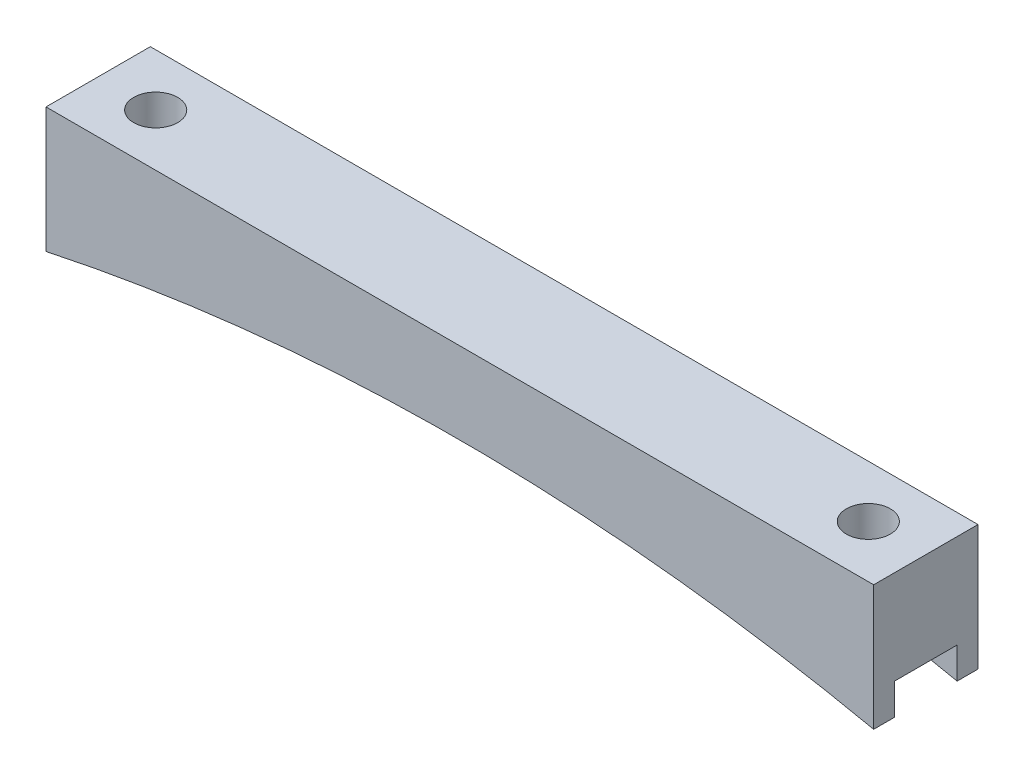
ISO-10303-21;
HEADER;
FILE_DESCRIPTION(('STEP AP214'),'2;1');
FILE_NAME('part.step','',(''),(''),'','','');
FILE_SCHEMA(('AUTOMOTIVE_DESIGN { 1 0 10303 214 1 1 1 1 }'));
ENDSEC;
DATA;
#1=APPLICATION_CONTEXT('core data for automotive mechanical design processes');
#2=APPLICATION_PROTOCOL_DEFINITION('international standard','automotive_design',2000,#1);
#3=PRODUCT_CONTEXT('',#1,'mechanical');
#4=PRODUCT('Part','Part','',(#3));
#5=PRODUCT_RELATED_PRODUCT_CATEGORY('part','',(#4));
#6=PRODUCT_DEFINITION_FORMATION('','',#4);
#7=PRODUCT_DEFINITION_CONTEXT('part definition',#1,'design');
#8=PRODUCT_DEFINITION('design','',#6,#7);
#9=PRODUCT_DEFINITION_SHAPE('','',#8);
#10=(LENGTH_UNIT() NAMED_UNIT(*) SI_UNIT(.MILLI.,.METRE.));
#11=(NAMED_UNIT(*) PLANE_ANGLE_UNIT() SI_UNIT($,.RADIAN.));
#12=(NAMED_UNIT(*) SI_UNIT($,.STERADIAN.) SOLID_ANGLE_UNIT());
#13=UNCERTAINTY_MEASURE_WITH_UNIT(LENGTH_MEASURE(1.E-05),#10,'distance_accuracy_value','');
#14=(GEOMETRIC_REPRESENTATION_CONTEXT(3) GLOBAL_UNCERTAINTY_ASSIGNED_CONTEXT((#13)) GLOBAL_UNIT_ASSIGNED_CONTEXT((#10,
#11,#12)) REPRESENTATION_CONTEXT('',''));
#15=CARTESIAN_POINT('',(0.,0.,0.));
#16=DIRECTION('',(0.,0.,1.));
#17=DIRECTION('',(1.,0.,0.));
#18=AXIS2_PLACEMENT_3D('',#15,#16,#17);
#19=CARTESIAN_POINT('',(50.37,0.,12.7));
#20=DIRECTION('',(-1.,0.,0.));
#21=DIRECTION('',(0.,0.,1.));
#22=AXIS2_PLACEMENT_3D('',#19,#20,#21);
#23=PLANE('',#22);
#24=DIRECTION('',(0.,0.,-1.));
#25=VECTOR('',#24,1.);
#26=CARTESIAN_POINT('',(50.37,-15.24,12.7));
#27=LINE('',#26,#25);
#28=CARTESIAN_POINT('',(50.37,-15.24,12.7));
#29=VERTEX_POINT('',#28);
#30=CARTESIAN_POINT('',(50.37,-15.24,10.16));
#31=VERTEX_POINT('',#30);
#32=EDGE_CURVE('E156',#29,#31,#27,.T.);
#33=ORIENTED_EDGE('',*,*,#32,.T.);
#34=DIRECTION('',(0.,-1.,0.));
#35=VECTOR('',#34,1.);
#36=CARTESIAN_POINT('',(50.37,-15.24,10.16));
#37=LINE('',#36,#35);
#38=CARTESIAN_POINT('',(50.37,-11.43,10.16));
#39=VERTEX_POINT('',#38);
#40=EDGE_CURVE('E185',#39,#31,#37,.T.);
#41=ORIENTED_EDGE('',*,*,#40,.F.);
#42=DIRECTION('',(0.,0.,1.));
#43=VECTOR('',#42,1.);
#44=CARTESIAN_POINT('',(50.37,-11.43,10.16));
#45=LINE('',#44,#43);
#46=CARTESIAN_POINT('',(50.37,-11.43,2.54));
#47=VERTEX_POINT('',#46);
#48=EDGE_CURVE('E141',#47,#39,#45,.T.);
#49=ORIENTED_EDGE('',*,*,#48,.F.);
#50=DIRECTION('',(0.,1.,0.));
#51=VECTOR('',#50,1.);
#52=CARTESIAN_POINT('',(50.37,-15.24,2.54));
#53=LINE('',#52,#51);
#54=CARTESIAN_POINT('',(50.37,-15.24,2.54));
#55=VERTEX_POINT('',#54);
#56=EDGE_CURVE('E177',#55,#47,#53,.T.);
#57=ORIENTED_EDGE('',*,*,#56,.F.);
#58=CARTESIAN_POINT('',(50.37,-15.24,0.));
#59=VERTEX_POINT('',#58);
#60=EDGE_CURVE('E174',#55,#59,#27,.T.);
#61=ORIENTED_EDGE('',*,*,#60,.T.);
#62=DIRECTION('',(0.,1.,0.));
#63=VECTOR('',#62,1.);
#64=CARTESIAN_POINT('',(50.37,0.,0.));
#65=LINE('',#64,#63);
#66=CARTESIAN_POINT('',(50.37,0.,0.));
#67=VERTEX_POINT('',#66);
#68=EDGE_CURVE('E213',#59,#67,#65,.T.);
#69=ORIENTED_EDGE('',*,*,#68,.T.);
#70=DIRECTION('',(0.,0.,-1.));
#71=VECTOR('',#70,1.);
#72=CARTESIAN_POINT('',(50.37,0.,12.7));
#73=LINE('',#72,#71);
#74=CARTESIAN_POINT('',(50.37,0.,12.7));
#75=VERTEX_POINT('',#74);
#76=EDGE_CURVE('E154',#75,#67,#73,.T.);
#77=ORIENTED_EDGE('',*,*,#76,.F.);
#78=DIRECTION('',(0.,1.,0.));
#79=VECTOR('',#78,1.);
#80=CARTESIAN_POINT('',(50.37,0.,12.7));
#81=LINE('',#80,#79);
#82=EDGE_CURVE('E217',#29,#75,#81,.T.);
#83=ORIENTED_EDGE('',*,*,#82,.F.);
#84=EDGE_LOOP('',(#33,#41,#49,#57,#61,#69,#77,#83));
#85=FACE_BOUND('',#84,.T.);
#86=ADVANCED_FACE('F43',(#85),#23,.F.);
#87=CARTESIAN_POINT('',(-50.37,0.,12.7));
#88=DIRECTION('',(0.,-1.,0.));
#89=DIRECTION('',(1.,0.,0.));
#90=AXIS2_PLACEMENT_3D('',#87,#88,#89);
#91=PLANE('',#90);
#92=CARTESIAN_POINT('',(-43.37,0.,6.35));
#93=DIRECTION('',(0.,1.,0.));
#94=DIRECTION('',(-1.,0.,0.));
#95=AXIS2_PLACEMENT_3D('',#92,#93,#94);
#96=CIRCLE('',#95,2.675);
#97=CARTESIAN_POINT('',(-46.045,0.,6.35));
#98=VERTEX_POINT('',#97);
#99=EDGE_CURVE('E209',#98,#98,#96,.T.);
#100=ORIENTED_EDGE('',*,*,#99,.F.);
#101=EDGE_LOOP('',(#100));
#102=FACE_BOUND('',#101,.T.);
#103=CARTESIAN_POINT('',(43.37,0.,6.35));
#104=DIRECTION('',(0.,1.,0.));
#105=DIRECTION('',(-1.,0.,0.));
#106=AXIS2_PLACEMENT_3D('',#103,#104,#105);
#107=CIRCLE('',#106,2.675);
#108=CARTESIAN_POINT('',(40.695,0.,6.35));
#109=VERTEX_POINT('',#108);
#110=EDGE_CURVE('E208',#109,#109,#107,.T.);
#111=ORIENTED_EDGE('',*,*,#110,.F.);
#112=EDGE_LOOP('',(#111));
#113=FACE_BOUND('',#112,.T.);
#114=DIRECTION('',(-1.,0.,0.));
#115=VECTOR('',#114,1.);
#116=CARTESIAN_POINT('',(-50.37,0.,0.));
#117=LINE('',#116,#115);
#118=CARTESIAN_POINT('',(-50.37,0.,0.));
#119=VERTEX_POINT('',#118);
#120=EDGE_CURVE('E232',#67,#119,#117,.T.);
#121=ORIENTED_EDGE('',*,*,#120,.T.);
#122=DIRECTION('',(0.,0.,-1.));
#123=VECTOR('',#122,1.);
#124=CARTESIAN_POINT('',(-50.37,0.,12.7));
#125=LINE('',#124,#123);
#126=CARTESIAN_POINT('',(-50.37,0.,12.7));
#127=VERTEX_POINT('',#126);
#128=EDGE_CURVE('E148',#127,#119,#125,.T.);
#129=ORIENTED_EDGE('',*,*,#128,.F.);
#130=DIRECTION('',(-1.,0.,0.));
#131=VECTOR('',#130,1.);
#132=CARTESIAN_POINT('',(-50.37,0.,12.7));
#133=LINE('',#132,#131);
#134=EDGE_CURVE('E221',#75,#127,#133,.T.);
#135=ORIENTED_EDGE('',*,*,#134,.F.);
#136=ORIENTED_EDGE('',*,*,#76,.T.);
#137=EDGE_LOOP('',(#121,#129,#135,#136));
#138=FACE_BOUND('',#137,.T.);
#139=ADVANCED_FACE('F247',(#102,#113,#138),#91,.F.);
#140=CARTESIAN_POINT('',(-50.37,0.,12.7));
#141=DIRECTION('',(1.,0.,0.));
#142=DIRECTION('',(0.,0.,-1.));
#143=AXIS2_PLACEMENT_3D('',#140,#141,#142);
#144=PLANE('',#143);
#145=DIRECTION('',(0.,0.,1.));
#146=VECTOR('',#145,1.);
#147=CARTESIAN_POINT('',(-50.37,-11.43,10.16));
#148=LINE('',#147,#146);
#149=CARTESIAN_POINT('',(-50.37,-11.43,2.54));
#150=VERTEX_POINT('',#149);
#151=CARTESIAN_POINT('',(-50.37,-11.43,10.16));
#152=VERTEX_POINT('',#151);
#153=EDGE_CURVE('E139',#150,#152,#148,.T.);
#154=ORIENTED_EDGE('',*,*,#153,.T.);
#155=DIRECTION('',(0.,-1.,0.));
#156=VECTOR('',#155,1.);
#157=CARTESIAN_POINT('',(-50.37,-15.24,10.16));
#158=LINE('',#157,#156);
#159=CARTESIAN_POINT('',(-50.37,-15.24,10.16));
#160=VERTEX_POINT('',#159);
#161=EDGE_CURVE('E124',#152,#160,#158,.T.);
#162=ORIENTED_EDGE('',*,*,#161,.T.);
#163=DIRECTION('',(0.,0.,-1.));
#164=VECTOR('',#163,1.);
#165=CARTESIAN_POINT('',(-50.37,-15.24,12.7));
#166=LINE('',#165,#164);
#167=CARTESIAN_POINT('',(-50.37,-15.24,12.7));
#168=VERTEX_POINT('',#167);
#169=EDGE_CURVE('E136',#168,#160,#166,.T.);
#170=ORIENTED_EDGE('',*,*,#169,.F.);
#171=DIRECTION('',(0.,-1.,0.));
#172=VECTOR('',#171,1.);
#173=CARTESIAN_POINT('',(-50.37,0.,12.7));
#174=LINE('',#173,#172);
#175=EDGE_CURVE('E225',#127,#168,#174,.T.);
#176=ORIENTED_EDGE('',*,*,#175,.F.);
#177=ORIENTED_EDGE('',*,*,#128,.T.);
#178=DIRECTION('',(0.,-1.,0.));
#179=VECTOR('',#178,1.);
#180=CARTESIAN_POINT('',(-50.37,0.,0.));
#181=LINE('',#180,#179);
#182=CARTESIAN_POINT('',(-50.37,-15.24,0.));
#183=VERTEX_POINT('',#182);
#184=EDGE_CURVE('E235',#119,#183,#181,.T.);
#185=ORIENTED_EDGE('',*,*,#184,.T.);
#186=CARTESIAN_POINT('',(-50.37,-15.24,2.54));
#187=VERTEX_POINT('',#186);
#188=EDGE_CURVE('E149',#187,#183,#166,.T.);
#189=ORIENTED_EDGE('',*,*,#188,.F.);
#190=DIRECTION('',(0.,1.,0.));
#191=VECTOR('',#190,1.);
#192=CARTESIAN_POINT('',(-50.37,-15.24,2.54));
#193=LINE('',#192,#191);
#194=EDGE_CURVE('E67',#187,#150,#193,.T.);
#195=ORIENTED_EDGE('',*,*,#194,.T.);
#196=EDGE_LOOP('',(#154,#162,#170,#176,#177,#185,#189,#195));
#197=FACE_BOUND('',#196,.T.);
#198=ADVANCED_FACE('F134',(#197),#144,.F.);
#199=CARTESIAN_POINT('',(0.,-251.224222142075,12.7));
#200=DIRECTION('',(0.,0.,-1.));
#201=DIRECTION('',(-1.,0.,0.));
#202=AXIS2_PLACEMENT_3D('',#199,#200,#201);
#203=CYLINDRICAL_SURFACE('',#202,241.3);
#204=DIRECTION('',(0.,0.,-1.));
#205=VECTOR('',#204,1.);
#206=CARTESIAN_POINT('',(26.9150706348206,-11.43,12.7));
#207=LINE('',#206,#205);
#208=CARTESIAN_POINT('',(26.9150706348206,-11.43,2.54));
#209=VERTEX_POINT('',#208);
#210=CARTESIAN_POINT('',(26.9150706348207,-11.43,10.16));
#211=VERTEX_POINT('',#210);
#212=EDGE_CURVE('E172',#209,#211,#207,.F.);
#213=ORIENTED_EDGE('',*,*,#212,.T.);
#214=CARTESIAN_POINT('',(0.,-251.224222142075,10.16));
#215=DIRECTION('',(0.,0.,1.));
#216=DIRECTION('',(1.,0.,0.));
#217=AXIS2_PLACEMENT_3D('',#214,#215,#216);
#218=CIRCLE('',#217,241.3);
#219=EDGE_CURVE('E11',#211,#31,#218,.F.);
#220=ORIENTED_EDGE('',*,*,#219,.T.);
#221=ORIENTED_EDGE('',*,*,#32,.F.);
#222=CARTESIAN_POINT('',(0.,-251.224222142075,12.7));
#223=DIRECTION('',(0.,0.,-1.));
#224=DIRECTION('',(-1.,0.,0.));
#225=AXIS2_PLACEMENT_3D('',#222,#223,#224);
#226=CIRCLE('',#225,241.3);
#227=EDGE_CURVE('E146',#168,#29,#226,.T.);
#228=ORIENTED_EDGE('',*,*,#227,.F.);
#229=ORIENTED_EDGE('',*,*,#169,.T.);
#230=CARTESIAN_POINT('',(-26.9150706348206,-11.43,10.16));
#231=VERTEX_POINT('',#230);
#232=EDGE_CURVE('E46',#160,#231,#218,.F.);
#233=ORIENTED_EDGE('',*,*,#232,.T.);
#234=DIRECTION('',(0.,0.,-1.));
#235=VECTOR('',#234,1.);
#236=CARTESIAN_POINT('',(-26.9150706348206,-11.43,12.7));
#237=LINE('',#236,#235);
#238=CARTESIAN_POINT('',(-26.9150706348206,-11.43,2.54));
#239=VERTEX_POINT('',#238);
#240=EDGE_CURVE('E203',#231,#239,#237,.T.);
#241=ORIENTED_EDGE('',*,*,#240,.T.);
#242=CARTESIAN_POINT('',(0.,-251.224222142075,2.54));
#243=DIRECTION('',(0.,0.,-1.));
#244=DIRECTION('',(-1.,0.,0.));
#245=AXIS2_PLACEMENT_3D('',#242,#243,#244);
#246=CIRCLE('',#245,241.3);
#247=EDGE_CURVE('E131',#239,#187,#246,.F.);
#248=ORIENTED_EDGE('',*,*,#247,.T.);
#249=ORIENTED_EDGE('',*,*,#188,.T.);
#250=CARTESIAN_POINT('',(0.,-251.224222142075,0.));
#251=DIRECTION('',(0.,0.,-1.));
#252=DIRECTION('',(-1.,0.,0.));
#253=AXIS2_PLACEMENT_3D('',#250,#251,#252);
#254=CIRCLE('',#253,241.3);
#255=EDGE_CURVE('E222',#183,#59,#254,.T.);
#256=ORIENTED_EDGE('',*,*,#255,.T.);
#257=ORIENTED_EDGE('',*,*,#60,.F.);
#258=EDGE_CURVE('E52',#55,#209,#246,.F.);
#259=ORIENTED_EDGE('',*,*,#258,.T.);
#260=EDGE_LOOP('',(#213,#220,#221,#228,#229,#233,#241,#248,#249,#256,#257,#259));
#261=FACE_BOUND('',#260,.T.);
#262=ADVANCED_FACE('F144',(#261),#203,.F.);
#263=CARTESIAN_POINT('',(0.,-251.224222142075,12.7));
#264=DIRECTION('',(0.,0.,-1.));
#265=DIRECTION('',(-1.,0.,0.));
#266=AXIS2_PLACEMENT_3D('',#263,#264,#265);
#267=PLANE('',#266);
#268=ORIENTED_EDGE('',*,*,#82,.T.);
#269=ORIENTED_EDGE('',*,*,#134,.T.);
#270=ORIENTED_EDGE('',*,*,#175,.T.);
#271=ORIENTED_EDGE('',*,*,#227,.T.);
#272=EDGE_LOOP('',(#268,#269,#270,#271));
#273=FACE_BOUND('',#272,.T.);
#274=ADVANCED_FACE('F250',(#273),#267,.F.);
#275=CARTESIAN_POINT('',(0.,-251.224222142075,0.));
#276=DIRECTION('',(0.,0.,-1.));
#277=DIRECTION('',(-1.,0.,0.));
#278=AXIS2_PLACEMENT_3D('',#275,#276,#277);
#279=PLANE('',#278);
#280=ORIENTED_EDGE('',*,*,#68,.F.);
#281=ORIENTED_EDGE('',*,*,#255,.F.);
#282=ORIENTED_EDGE('',*,*,#184,.F.);
#283=ORIENTED_EDGE('',*,*,#120,.F.);
#284=EDGE_LOOP('',(#280,#281,#282,#283));
#285=FACE_BOUND('',#284,.T.);
#286=ADVANCED_FACE('F243',(#285),#279,.T.);
#287=CARTESIAN_POINT('',(43.37,-15.24,6.35));
#288=DIRECTION('',(0.,1.,0.));
#289=DIRECTION('',(-1.,0.,0.));
#290=AXIS2_PLACEMENT_3D('',#287,#288,#289);
#291=CYLINDRICAL_SURFACE('',#290,2.675);
#292=CARTESIAN_POINT('',(43.37,-11.43,6.35));
#293=DIRECTION('',(0.,1.,0.));
#294=DIRECTION('',(0.,0.,1.));
#295=AXIS2_PLACEMENT_3D('',#292,#293,#294);
#296=CIRCLE('',#295,2.675);
#297=CARTESIAN_POINT('',(43.37,-11.43,9.025));
#298=VERTEX_POINT('',#297);
#299=EDGE_CURVE('E166',#298,#298,#296,.F.);
#300=ORIENTED_EDGE('',*,*,#299,.T.);
#301=EDGE_LOOP('',(#300));
#302=FACE_BOUND('',#301,.T.);
#303=ORIENTED_EDGE('',*,*,#110,.T.);
#304=EDGE_LOOP('',(#303));
#305=FACE_BOUND('',#304,.T.);
#306=ADVANCED_FACE('F292',(#302,#305),#291,.F.);
#307=CARTESIAN_POINT('',(-43.37,-15.24,6.35));
#308=DIRECTION('',(0.,1.,0.));
#309=DIRECTION('',(-1.,0.,0.));
#310=AXIS2_PLACEMENT_3D('',#307,#308,#309);
#311=CYLINDRICAL_SURFACE('',#310,2.675);
#312=CARTESIAN_POINT('',(-43.37,-11.43,6.35));
#313=DIRECTION('',(0.,1.,0.));
#314=DIRECTION('',(0.,0.,1.));
#315=AXIS2_PLACEMENT_3D('',#312,#313,#314);
#316=CIRCLE('',#315,2.675);
#317=CARTESIAN_POINT('',(-43.37,-11.43,9.025));
#318=VERTEX_POINT('',#317);
#319=EDGE_CURVE('E163',#318,#318,#316,.F.);
#320=ORIENTED_EDGE('',*,*,#319,.T.);
#321=EDGE_LOOP('',(#320));
#322=FACE_BOUND('',#321,.T.);
#323=ORIENTED_EDGE('',*,*,#99,.T.);
#324=EDGE_LOOP('',(#323));
#325=FACE_BOUND('',#324,.T.);
#326=ADVANCED_FACE('F274',(#322,#325),#311,.F.);
#327=CARTESIAN_POINT('',(-50.37,-11.43,10.16));
#328=DIRECTION('',(0.,1.,0.));
#329=DIRECTION('',(0.,0.,1.));
#330=AXIS2_PLACEMENT_3D('',#327,#328,#329);
#331=PLANE('',#330);
#332=ORIENTED_EDGE('',*,*,#319,.F.);
#333=EDGE_LOOP('',(#332));
#334=FACE_BOUND('',#333,.T.);
#335=DIRECTION('',(1.,0.,0.));
#336=VECTOR('',#335,1.);
#337=CARTESIAN_POINT('',(-50.37,-11.43,10.16));
#338=LINE('',#337,#336);
#339=EDGE_CURVE('E126',#152,#231,#338,.T.);
#340=ORIENTED_EDGE('',*,*,#339,.F.);
#341=ORIENTED_EDGE('',*,*,#153,.F.);
#342=DIRECTION('',(1.,0.,0.));
#343=VECTOR('',#342,1.);
#344=CARTESIAN_POINT('',(-50.37,-11.43,2.54));
#345=LINE('',#344,#343);
#346=EDGE_CURVE('E196',#150,#239,#345,.T.);
#347=ORIENTED_EDGE('',*,*,#346,.T.);
#348=ORIENTED_EDGE('',*,*,#240,.F.);
#349=EDGE_LOOP('',(#340,#341,#347,#348));
#350=FACE_BOUND('',#349,.T.);
#351=ADVANCED_FACE('F266',(#334,#350),#331,.F.);
#352=CARTESIAN_POINT('',(-50.37,-15.24,2.54));
#353=DIRECTION('',(0.,0.,-1.));
#354=DIRECTION('',(-1.,0.,0.));
#355=AXIS2_PLACEMENT_3D('',#352,#353,#354);
#356=PLANE('',#355);
#357=ORIENTED_EDGE('',*,*,#346,.F.);
#358=ORIENTED_EDGE('',*,*,#194,.F.);
#359=ORIENTED_EDGE('',*,*,#247,.F.);
#360=EDGE_LOOP('',(#357,#358,#359));
#361=FACE_BOUND('',#360,.T.);
#362=ADVANCED_FACE('F271',(#361),#356,.F.);
#363=CARTESIAN_POINT('',(-50.37,-15.24,10.16));
#364=DIRECTION('',(0.,0.,1.));
#365=DIRECTION('',(1.,0.,0.));
#366=AXIS2_PLACEMENT_3D('',#363,#364,#365);
#367=PLANE('',#366);
#368=ORIENTED_EDGE('',*,*,#161,.F.);
#369=ORIENTED_EDGE('',*,*,#339,.T.);
#370=ORIENTED_EDGE('',*,*,#232,.F.);
#371=EDGE_LOOP('',(#368,#369,#370));
#372=FACE_BOUND('',#371,.T.);
#373=ADVANCED_FACE('F123',(#372),#367,.F.);
#374=EDGE_CURVE('E195',#211,#39,#338,.T.);
#375=ORIENTED_EDGE('',*,*,#374,.T.);
#376=ORIENTED_EDGE('',*,*,#40,.T.);
#377=ORIENTED_EDGE('',*,*,#219,.F.);
#378=EDGE_LOOP('',(#375,#376,#377));
#379=FACE_BOUND('',#378,.T.);
#380=ADVANCED_FACE('F254',(#379),#367,.F.);
#381=ORIENTED_EDGE('',*,*,#56,.T.);
#382=EDGE_CURVE('E59',#209,#47,#345,.T.);
#383=ORIENTED_EDGE('',*,*,#382,.F.);
#384=ORIENTED_EDGE('',*,*,#258,.F.);
#385=EDGE_LOOP('',(#381,#383,#384));
#386=FACE_BOUND('',#385,.T.);
#387=ADVANCED_FACE('F176',(#386),#356,.F.);
#388=ORIENTED_EDGE('',*,*,#299,.F.);
#389=EDGE_LOOP('',(#388));
#390=FACE_BOUND('',#389,.T.);
#391=ORIENTED_EDGE('',*,*,#382,.T.);
#392=ORIENTED_EDGE('',*,*,#48,.T.);
#393=ORIENTED_EDGE('',*,*,#374,.F.);
#394=ORIENTED_EDGE('',*,*,#212,.F.);
#395=EDGE_LOOP('',(#391,#392,#393,#394));
#396=FACE_BOUND('',#395,.T.);
#397=ADVANCED_FACE('F258',(#390,#396),#331,.F.);
#398=CLOSED_SHELL('',(#86,#139,#198,#262,#274,#286,#306,#326,#351,#362,#373,#380,#387,#397));
#399=MANIFOLD_SOLID_BREP('B2',#398);
#400=ADVANCED_BREP_SHAPE_REPRESENTATION('',(#18,#399),#14);
#401=SHAPE_DEFINITION_REPRESENTATION(#9,#400);
ENDSEC;
END-ISO-10303-21;
